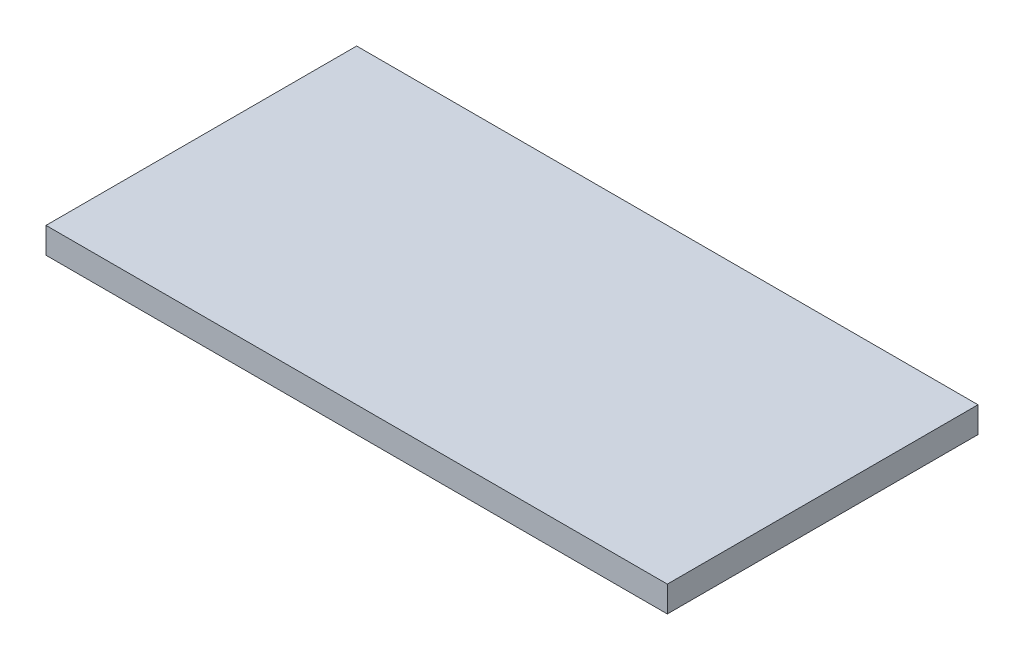
ISO-10303-21;
HEADER;
FILE_DESCRIPTION(('STEP AP214'),'2;1');
FILE_NAME('part.step','',(''),(''),'','','');
FILE_SCHEMA(('AUTOMOTIVE_DESIGN { 1 0 10303 214 1 1 1 1 }'));
ENDSEC;
DATA;
#1=APPLICATION_CONTEXT('core data for automotive mechanical design processes');
#2=APPLICATION_PROTOCOL_DEFINITION('international standard','automotive_design',2000,#1);
#3=PRODUCT_CONTEXT('',#1,'mechanical');
#4=PRODUCT('Part','Part','',(#3));
#5=PRODUCT_RELATED_PRODUCT_CATEGORY('part','',(#4));
#6=PRODUCT_DEFINITION_FORMATION('','',#4);
#7=PRODUCT_DEFINITION_CONTEXT('part definition',#1,'design');
#8=PRODUCT_DEFINITION('design','',#6,#7);
#9=PRODUCT_DEFINITION_SHAPE('','',#8);
#10=(LENGTH_UNIT() NAMED_UNIT(*) SI_UNIT(.MILLI.,.METRE.));
#11=(NAMED_UNIT(*) PLANE_ANGLE_UNIT() SI_UNIT($,.RADIAN.));
#12=(NAMED_UNIT(*) SI_UNIT($,.STERADIAN.) SOLID_ANGLE_UNIT());
#13=UNCERTAINTY_MEASURE_WITH_UNIT(LENGTH_MEASURE(1.E-05),#10,'distance_accuracy_value','');
#14=(GEOMETRIC_REPRESENTATION_CONTEXT(3) GLOBAL_UNCERTAINTY_ASSIGNED_CONTEXT((#13)) GLOBAL_UNIT_ASSIGNED_CONTEXT((#10,
#11,#12)) REPRESENTATION_CONTEXT('',''));
#15=CARTESIAN_POINT('',(0.,0.,0.));
#16=DIRECTION('',(0.,0.,1.));
#17=DIRECTION('',(1.,0.,0.));
#18=AXIS2_PLACEMENT_3D('',#15,#16,#17);
#19=CARTESIAN_POINT('',(0.,50.,0.));
#20=DIRECTION('',(1.,0.,0.));
#21=DIRECTION('',(0.,0.,-1.));
#22=AXIS2_PLACEMENT_3D('',#19,#20,#21);
#23=PLANE('',#22);
#24=DIRECTION('',(0.,0.,1.));
#25=VECTOR('',#24,1.);
#26=CARTESIAN_POINT('',(0.,0.,0.));
#27=LINE('',#26,#25);
#28=CARTESIAN_POINT('',(0.,0.,-600.));
#29=VERTEX_POINT('',#28);
#30=CARTESIAN_POINT('',(0.,0.,0.));
#31=VERTEX_POINT('',#30);
#32=EDGE_CURVE('E97',#29,#31,#27,.T.);
#33=ORIENTED_EDGE('',*,*,#32,.T.);
#34=DIRECTION('',(0.,-1.,0.));
#35=VECTOR('',#34,1.);
#36=CARTESIAN_POINT('',(0.,50.,0.));
#37=LINE('',#36,#35);
#38=CARTESIAN_POINT('',(0.,50.,0.));
#39=VERTEX_POINT('',#38);
#40=EDGE_CURVE('E11',#39,#31,#37,.T.);
#41=ORIENTED_EDGE('',*,*,#40,.F.);
#42=DIRECTION('',(0.,0.,1.));
#43=VECTOR('',#42,1.);
#44=CARTESIAN_POINT('',(0.,50.,0.));
#45=LINE('',#44,#43);
#46=CARTESIAN_POINT('',(0.,50.,-600.));
#47=VERTEX_POINT('',#46);
#48=EDGE_CURVE('E85',#47,#39,#45,.T.);
#49=ORIENTED_EDGE('',*,*,#48,.F.);
#50=DIRECTION('',(0.,-1.,0.));
#51=VECTOR('',#50,1.);
#52=CARTESIAN_POINT('',(0.,50.,-600.));
#53=LINE('',#52,#51);
#54=EDGE_CURVE('E93',#47,#29,#53,.T.);
#55=ORIENTED_EDGE('',*,*,#54,.T.);
#56=EDGE_LOOP('',(#33,#41,#49,#55));
#57=FACE_BOUND('',#56,.T.);
#58=ADVANCED_FACE('F34',(#57),#23,.F.);
#59=CARTESIAN_POINT('',(0.,50.,0.));
#60=DIRECTION('',(0.,0.,-1.));
#61=DIRECTION('',(-1.,0.,0.));
#62=AXIS2_PLACEMENT_3D('',#59,#60,#61);
#63=PLANE('',#62);
#64=DIRECTION('',(1.,0.,0.));
#65=VECTOR('',#64,1.);
#66=CARTESIAN_POINT('',(0.,0.,0.));
#67=LINE('',#66,#65);
#68=CARTESIAN_POINT('',(1200.,0.,0.));
#69=VERTEX_POINT('',#68);
#70=EDGE_CURVE('E89',#31,#69,#67,.T.);
#71=ORIENTED_EDGE('',*,*,#70,.T.);
#72=DIRECTION('',(0.,-1.,0.));
#73=VECTOR('',#72,1.);
#74=CARTESIAN_POINT('',(1200.,50.,0.));
#75=LINE('',#74,#73);
#76=CARTESIAN_POINT('',(1200.,50.,0.));
#77=VERTEX_POINT('',#76);
#78=EDGE_CURVE('E42',#77,#69,#75,.T.);
#79=ORIENTED_EDGE('',*,*,#78,.F.);
#80=DIRECTION('',(1.,0.,0.));
#81=VECTOR('',#80,1.);
#82=CARTESIAN_POINT('',(0.,50.,0.));
#83=LINE('',#82,#81);
#84=EDGE_CURVE('E80',#39,#77,#83,.T.);
#85=ORIENTED_EDGE('',*,*,#84,.F.);
#86=ORIENTED_EDGE('',*,*,#40,.T.);
#87=EDGE_LOOP('',(#71,#79,#85,#86));
#88=FACE_BOUND('',#87,.T.);
#89=ADVANCED_FACE('F88',(#88),#63,.F.);
#90=CARTESIAN_POINT('',(1200.,50.,0.));
#91=DIRECTION('',(-1.,0.,0.));
#92=DIRECTION('',(0.,0.,1.));
#93=AXIS2_PLACEMENT_3D('',#90,#91,#92);
#94=PLANE('',#93);
#95=DIRECTION('',(0.,0.,-1.));
#96=VECTOR('',#95,1.);
#97=CARTESIAN_POINT('',(1200.,0.,0.));
#98=LINE('',#97,#96);
#99=CARTESIAN_POINT('',(1200.,0.,-600.));
#100=VERTEX_POINT('',#99);
#101=EDGE_CURVE('E67',#69,#100,#98,.T.);
#102=ORIENTED_EDGE('',*,*,#101,.T.);
#103=DIRECTION('',(0.,-1.,0.));
#104=VECTOR('',#103,1.);
#105=CARTESIAN_POINT('',(1200.,50.,-600.));
#106=LINE('',#105,#104);
#107=CARTESIAN_POINT('',(1200.,50.,-600.));
#108=VERTEX_POINT('',#107);
#109=EDGE_CURVE('E90',#108,#100,#106,.T.);
#110=ORIENTED_EDGE('',*,*,#109,.F.);
#111=DIRECTION('',(0.,0.,-1.));
#112=VECTOR('',#111,1.);
#113=CARTESIAN_POINT('',(1200.,50.,0.));
#114=LINE('',#113,#112);
#115=EDGE_CURVE('E83',#77,#108,#114,.T.);
#116=ORIENTED_EDGE('',*,*,#115,.F.);
#117=ORIENTED_EDGE('',*,*,#78,.T.);
#118=EDGE_LOOP('',(#102,#110,#116,#117));
#119=FACE_BOUND('',#118,.T.);
#120=ADVANCED_FACE('F91',(#119),#94,.F.);
#121=CARTESIAN_POINT('',(0.,50.,-600.));
#122=DIRECTION('',(0.,0.,1.));
#123=DIRECTION('',(1.,0.,0.));
#124=AXIS2_PLACEMENT_3D('',#121,#122,#123);
#125=PLANE('',#124);
#126=DIRECTION('',(-1.,0.,0.));
#127=VECTOR('',#126,1.);
#128=CARTESIAN_POINT('',(0.,0.,-600.));
#129=LINE('',#128,#127);
#130=EDGE_CURVE('E73',#100,#29,#129,.T.);
#131=ORIENTED_EDGE('',*,*,#130,.T.);
#132=ORIENTED_EDGE('',*,*,#54,.F.);
#133=DIRECTION('',(-1.,0.,0.));
#134=VECTOR('',#133,1.);
#135=CARTESIAN_POINT('',(0.,50.,-600.));
#136=LINE('',#135,#134);
#137=EDGE_CURVE('E50',#108,#47,#136,.T.);
#138=ORIENTED_EDGE('',*,*,#137,.F.);
#139=ORIENTED_EDGE('',*,*,#109,.T.);
#140=EDGE_LOOP('',(#131,#132,#138,#139));
#141=FACE_BOUND('',#140,.T.);
#142=ADVANCED_FACE('F104',(#141),#125,.F.);
#143=CARTESIAN_POINT('',(0.,50.,0.));
#144=DIRECTION('',(0.,-1.,0.));
#145=DIRECTION('',(0.,0.,-1.));
#146=AXIS2_PLACEMENT_3D('',#143,#144,#145);
#147=PLANE('',#146);
#148=ORIENTED_EDGE('',*,*,#48,.T.);
#149=ORIENTED_EDGE('',*,*,#84,.T.);
#150=ORIENTED_EDGE('',*,*,#115,.T.);
#151=ORIENTED_EDGE('',*,*,#137,.T.);
#152=EDGE_LOOP('',(#148,#149,#150,#151));
#153=FACE_BOUND('',#152,.T.);
#154=ADVANCED_FACE('F81',(#153),#147,.F.);
#155=CARTESIAN_POINT('',(0.,0.,0.));
#156=DIRECTION('',(0.,-1.,0.));
#157=DIRECTION('',(0.,0.,-1.));
#158=AXIS2_PLACEMENT_3D('',#155,#156,#157);
#159=PLANE('',#158);
#160=ORIENTED_EDGE('',*,*,#32,.F.);
#161=ORIENTED_EDGE('',*,*,#130,.F.);
#162=ORIENTED_EDGE('',*,*,#101,.F.);
#163=ORIENTED_EDGE('',*,*,#70,.F.);
#164=EDGE_LOOP('',(#160,#161,#162,#163));
#165=FACE_BOUND('',#164,.T.);
#166=ADVANCED_FACE('F107',(#165),#159,.T.);
#167=CLOSED_SHELL('',(#58,#89,#120,#142,#154,#166));
#168=MANIFOLD_SOLID_BREP('B2',#167);
#169=ADVANCED_BREP_SHAPE_REPRESENTATION('',(#18,#168),#14);
#170=SHAPE_DEFINITION_REPRESENTATION(#9,#169);
ENDSEC;
END-ISO-10303-21;
